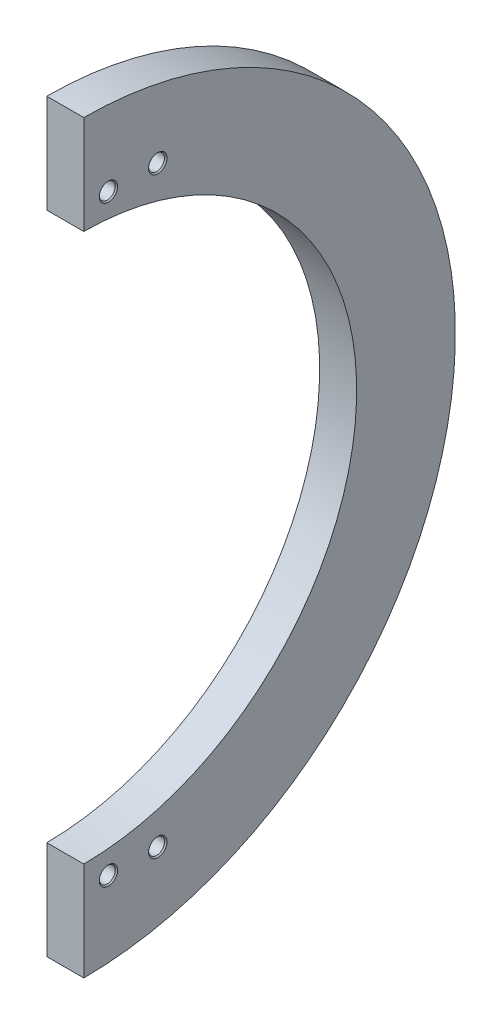
ISO-10303-21;
HEADER;
FILE_DESCRIPTION(('STEP AP214'),'2;1');
FILE_NAME('part.step','',(''),(''),'','','');
FILE_SCHEMA(('AUTOMOTIVE_DESIGN { 1 0 10303 214 1 1 1 1 }'));
ENDSEC;
DATA;
#1=APPLICATION_CONTEXT('core data for automotive mechanical design processes');
#2=APPLICATION_PROTOCOL_DEFINITION('international standard','automotive_design',2000,#1);
#3=PRODUCT_CONTEXT('',#1,'mechanical');
#4=PRODUCT('Part','Part','',(#3));
#5=PRODUCT_RELATED_PRODUCT_CATEGORY('part','',(#4));
#6=PRODUCT_DEFINITION_FORMATION('','',#4);
#7=PRODUCT_DEFINITION_CONTEXT('part definition',#1,'design');
#8=PRODUCT_DEFINITION('design','',#6,#7);
#9=PRODUCT_DEFINITION_SHAPE('','',#8);
#10=(LENGTH_UNIT() NAMED_UNIT(*) SI_UNIT(.MILLI.,.METRE.));
#11=(NAMED_UNIT(*) PLANE_ANGLE_UNIT() SI_UNIT($,.RADIAN.));
#12=(NAMED_UNIT(*) SI_UNIT($,.STERADIAN.) SOLID_ANGLE_UNIT());
#13=UNCERTAINTY_MEASURE_WITH_UNIT(LENGTH_MEASURE(1.E-05),#10,'distance_accuracy_value','');
#14=(GEOMETRIC_REPRESENTATION_CONTEXT(3) GLOBAL_UNCERTAINTY_ASSIGNED_CONTEXT((#13)) GLOBAL_UNIT_ASSIGNED_CONTEXT((#10,
#11,#12)) REPRESENTATION_CONTEXT('',''));
#15=CARTESIAN_POINT('',(0.,0.,0.));
#16=DIRECTION('',(0.,0.,1.));
#17=DIRECTION('',(1.,0.,0.));
#18=AXIS2_PLACEMENT_3D('',#15,#16,#17);
#19=CARTESIAN_POINT('',(19.05,-191.7625,1.33907038047981E-12));
#20=DIRECTION('',(-1.,0.,0.));
#21=DIRECTION('',(0.,0.,1.));
#22=AXIS2_PLACEMENT_3D('',#19,#20,#21);
#23=PLANE('',#22);
#24=CARTESIAN_POINT('',(19.05,152.4,-38.6000000000001));
#25=DIRECTION('',(1.,0.,0.));
#26=DIRECTION('',(0.,0.,-1.));
#27=AXIS2_PLACEMENT_3D('',#24,#25,#26);
#28=CIRCLE('',#27,4.73709999999999);
#29=CARTESIAN_POINT('',(19.05,152.4,-43.3371));
#30=VERTEX_POINT('',#29);
#31=EDGE_CURVE('E144',#30,#30,#28,.T.);
#32=ORIENTED_EDGE('',*,*,#31,.F.);
#33=EDGE_LOOP('',(#32));
#34=FACE_BOUND('',#33,.T.);
#35=CARTESIAN_POINT('',(19.05,152.4,-13.2000000000001));
#36=DIRECTION('',(1.,0.,0.));
#37=DIRECTION('',(0.,0.,-1.));
#38=AXIS2_PLACEMENT_3D('',#35,#36,#37);
#39=CIRCLE('',#38,4.73709999999999);
#40=CARTESIAN_POINT('',(19.05,152.4,-17.9371));
#41=VERTEX_POINT('',#40);
#42=EDGE_CURVE('E132',#41,#41,#39,.T.);
#43=ORIENTED_EDGE('',*,*,#42,.F.);
#44=EDGE_LOOP('',(#43));
#45=FACE_BOUND('',#44,.T.);
#46=CARTESIAN_POINT('',(19.05,-152.4,-38.6000000000001));
#47=DIRECTION('',(1.,0.,0.));
#48=DIRECTION('',(0.,0.,-1.));
#49=AXIS2_PLACEMENT_3D('',#46,#47,#48);
#50=CIRCLE('',#49,4.73709999999999);
#51=CARTESIAN_POINT('',(19.05,-152.4,-43.3371));
#52=VERTEX_POINT('',#51);
#53=EDGE_CURVE('E120',#52,#52,#50,.T.);
#54=ORIENTED_EDGE('',*,*,#53,.F.);
#55=EDGE_LOOP('',(#54));
#56=FACE_BOUND('',#55,.T.);
#57=DIRECTION('',(0.,1.,0.));
#58=VECTOR('',#57,1.);
#59=CARTESIAN_POINT('',(19.05,215.,-0.500000000000053));
#60=LINE('',#59,#58);
#61=CARTESIAN_POINT('',(19.05,-191.761848150903,-0.500000000000053));
#62=VERTEX_POINT('',#61);
#63=CARTESIAN_POINT('',(19.05,-140.961613236548,-0.500000000000053));
#64=VERTEX_POINT('',#63);
#65=EDGE_CURVE('E99',#62,#64,#60,.T.);
#66=ORIENTED_EDGE('',*,*,#65,.F.);
#67=CARTESIAN_POINT('',(19.05,0.,0.));
#68=DIRECTION('',(1.,0.,0.));
#69=DIRECTION('',(0.,0.,-1.));
#70=AXIS2_PLACEMENT_3D('',#67,#68,#69);
#71=CIRCLE('',#70,191.7625);
#72=CARTESIAN_POINT('',(19.05,191.761848150903,-0.500000000000053));
#73=VERTEX_POINT('',#72);
#74=EDGE_CURVE('E88',#62,#73,#71,.T.);
#75=ORIENTED_EDGE('',*,*,#74,.T.);
#76=CARTESIAN_POINT('',(19.05,140.961613236547,-0.500000000000053));
#77=VERTEX_POINT('',#76);
#78=EDGE_CURVE('E79',#77,#73,#60,.T.);
#79=ORIENTED_EDGE('',*,*,#78,.F.);
#80=CARTESIAN_POINT('',(19.05,0.,0.));
#81=DIRECTION('',(1.,0.,0.));
#82=DIRECTION('',(0.,0.,-1.));
#83=AXIS2_PLACEMENT_3D('',#80,#81,#82);
#84=CIRCLE('',#83,140.9625);
#85=EDGE_CURVE('E92',#64,#77,#84,.T.);
#86=ORIENTED_EDGE('',*,*,#85,.F.);
#87=EDGE_LOOP('',(#66,#75,#79,#86));
#88=FACE_BOUND('',#87,.T.);
#89=CARTESIAN_POINT('',(19.05,-152.4,-13.2000000000001));
#90=DIRECTION('',(1.,0.,0.));
#91=DIRECTION('',(0.,0.,-1.));
#92=AXIS2_PLACEMENT_3D('',#89,#90,#91);
#93=CIRCLE('',#92,4.73709999999999);
#94=CARTESIAN_POINT('',(19.05,-152.4,-17.9371));
#95=VERTEX_POINT('',#94);
#96=EDGE_CURVE('E108',#95,#95,#93,.T.);
#97=ORIENTED_EDGE('',*,*,#96,.F.);
#98=EDGE_LOOP('',(#97));
#99=FACE_BOUND('',#98,.T.);
#100=ADVANCED_FACE('F33',(#34,#45,#56,#88,#99),#23,.F.);
#101=CARTESIAN_POINT('',(0.,0.,0.));
#102=DIRECTION('',(1.,0.,0.));
#103=DIRECTION('',(0.,0.,-1.));
#104=AXIS2_PLACEMENT_3D('',#101,#102,#103);
#105=CYLINDRICAL_SURFACE('',#104,140.9625);
#106=CARTESIAN_POINT('',(0.,0.,0.));
#107=DIRECTION('',(1.,0.,0.));
#108=DIRECTION('',(0.,0.,-1.));
#109=AXIS2_PLACEMENT_3D('',#106,#107,#108);
#110=CIRCLE('',#109,140.9625);
#111=CARTESIAN_POINT('',(0.,-140.961613236548,-0.500000000000053));
#112=VERTEX_POINT('',#111);
#113=CARTESIAN_POINT('',(0.,140.961613236547,-0.500000000000053));
#114=VERTEX_POINT('',#113);
#115=EDGE_CURVE('E11',#112,#114,#110,.T.);
#116=ORIENTED_EDGE('',*,*,#115,.F.);
#117=DIRECTION('',(1.,0.,0.));
#118=VECTOR('',#117,1.);
#119=CARTESIAN_POINT('',(0.,-140.961613236547,-0.500000000000053));
#120=LINE('',#119,#118);
#121=EDGE_CURVE('E75',#112,#64,#120,.T.);
#122=ORIENTED_EDGE('',*,*,#121,.T.);
#123=ORIENTED_EDGE('',*,*,#85,.T.);
#124=DIRECTION('',(1.,0.,0.));
#125=VECTOR('',#124,1.);
#126=CARTESIAN_POINT('',(0.,140.961613236547,-0.500000000000053));
#127=LINE('',#126,#125);
#128=EDGE_CURVE('E48',#77,#114,#127,.F.);
#129=ORIENTED_EDGE('',*,*,#128,.T.);
#130=EDGE_LOOP('',(#116,#122,#123,#129));
#131=FACE_BOUND('',#130,.T.);
#132=ADVANCED_FACE('F174',(#131),#105,.F.);
#133=CARTESIAN_POINT('',(0.,-140.9625,9.8433587645335E-13));
#134=DIRECTION('',(1.,0.,0.));
#135=DIRECTION('',(0.,0.,-1.));
#136=AXIS2_PLACEMENT_3D('',#133,#134,#135);
#137=PLANE('',#136);
#138=CARTESIAN_POINT('',(0.,152.4,-38.6000000000001));
#139=DIRECTION('',(1.,0.,0.));
#140=DIRECTION('',(0.,0.,-1.));
#141=AXIS2_PLACEMENT_3D('',#138,#139,#140);
#142=CIRCLE('',#141,4.73709999999999);
#143=CARTESIAN_POINT('',(0.,152.4,-43.3371));
#144=VERTEX_POINT('',#143);
#145=EDGE_CURVE('E147',#144,#144,#142,.T.);
#146=ORIENTED_EDGE('',*,*,#145,.T.);
#147=EDGE_LOOP('',(#146));
#148=FACE_BOUND('',#147,.T.);
#149=CARTESIAN_POINT('',(0.,152.4,-13.2000000000001));
#150=DIRECTION('',(1.,0.,0.));
#151=DIRECTION('',(0.,0.,-1.));
#152=AXIS2_PLACEMENT_3D('',#149,#150,#151);
#153=CIRCLE('',#152,4.73709999999999);
#154=CARTESIAN_POINT('',(0.,152.4,-17.9371));
#155=VERTEX_POINT('',#154);
#156=EDGE_CURVE('E135',#155,#155,#153,.T.);
#157=ORIENTED_EDGE('',*,*,#156,.T.);
#158=EDGE_LOOP('',(#157));
#159=FACE_BOUND('',#158,.T.);
#160=CARTESIAN_POINT('',(0.,-152.4,-38.6000000000001));
#161=DIRECTION('',(1.,0.,0.));
#162=DIRECTION('',(0.,0.,-1.));
#163=AXIS2_PLACEMENT_3D('',#160,#161,#162);
#164=CIRCLE('',#163,4.73709999999999);
#165=CARTESIAN_POINT('',(0.,-152.4,-43.3371));
#166=VERTEX_POINT('',#165);
#167=EDGE_CURVE('E123',#166,#166,#164,.T.);
#168=ORIENTED_EDGE('',*,*,#167,.T.);
#169=EDGE_LOOP('',(#168));
#170=FACE_BOUND('',#169,.T.);
#171=CARTESIAN_POINT('',(0.,-152.4,-13.2000000000001));
#172=DIRECTION('',(1.,0.,0.));
#173=DIRECTION('',(0.,0.,-1.));
#174=AXIS2_PLACEMENT_3D('',#171,#172,#173);
#175=CIRCLE('',#174,4.73709999999999);
#176=CARTESIAN_POINT('',(0.,-152.4,-17.9371));
#177=VERTEX_POINT('',#176);
#178=EDGE_CURVE('E111',#177,#177,#175,.T.);
#179=ORIENTED_EDGE('',*,*,#178,.T.);
#180=EDGE_LOOP('',(#179));
#181=FACE_BOUND('',#180,.T.);
#182=DIRECTION('',(0.,1.,0.));
#183=VECTOR('',#182,1.);
#184=CARTESIAN_POINT('',(0.,215.,-0.500000000000053));
#185=LINE('',#184,#183);
#186=CARTESIAN_POINT('',(0.,191.761848150903,-0.500000000000053));
#187=VERTEX_POINT('',#186);
#188=EDGE_CURVE('E80',#114,#187,#185,.T.);
#189=ORIENTED_EDGE('',*,*,#188,.T.);
#190=CARTESIAN_POINT('',(0.,0.,0.));
#191=DIRECTION('',(1.,0.,0.));
#192=DIRECTION('',(0.,0.,-1.));
#193=AXIS2_PLACEMENT_3D('',#190,#191,#192);
#194=CIRCLE('',#193,191.7625);
#195=CARTESIAN_POINT('',(0.,-191.761848150903,-0.500000000000053));
#196=VERTEX_POINT('',#195);
#197=EDGE_CURVE('E41',#196,#187,#194,.T.);
#198=ORIENTED_EDGE('',*,*,#197,.F.);
#199=EDGE_CURVE('E72',#196,#112,#185,.T.);
#200=ORIENTED_EDGE('',*,*,#199,.T.);
#201=ORIENTED_EDGE('',*,*,#115,.T.);
#202=EDGE_LOOP('',(#189,#198,#200,#201));
#203=FACE_BOUND('',#202,.T.);
#204=ADVANCED_FACE('F35',(#148,#159,#170,#181,#203),#137,.F.);
#205=CARTESIAN_POINT('',(0.,0.,0.));
#206=DIRECTION('',(1.,0.,0.));
#207=DIRECTION('',(0.,0.,-1.));
#208=AXIS2_PLACEMENT_3D('',#205,#206,#207);
#209=CYLINDRICAL_SURFACE('',#208,191.7625);
#210=DIRECTION('',(1.,0.,0.));
#211=VECTOR('',#210,1.);
#212=CARTESIAN_POINT('',(0.,-191.761848150903,-0.500000000000053));
#213=LINE('',#212,#211);
#214=EDGE_CURVE('E56',#196,#62,#213,.T.);
#215=ORIENTED_EDGE('',*,*,#214,.F.);
#216=ORIENTED_EDGE('',*,*,#197,.T.);
#217=DIRECTION('',(1.,0.,0.));
#218=VECTOR('',#217,1.);
#219=CARTESIAN_POINT('',(0.,191.761848150903,-0.500000000000053));
#220=LINE('',#219,#218);
#221=EDGE_CURVE('E89',#73,#187,#220,.F.);
#222=ORIENTED_EDGE('',*,*,#221,.F.);
#223=ORIENTED_EDGE('',*,*,#74,.F.);
#224=EDGE_LOOP('',(#215,#216,#222,#223));
#225=FACE_BOUND('',#224,.T.);
#226=ADVANCED_FACE('F85',(#225),#209,.T.);
#227=CARTESIAN_POINT('',(19.05,215.,-0.500000000000053));
#228=DIRECTION('',(0.,0.,1.));
#229=DIRECTION('',(1.,0.,0.));
#230=AXIS2_PLACEMENT_3D('',#227,#228,#229);
#231=PLANE('',#230);
#232=ORIENTED_EDGE('',*,*,#78,.T.);
#233=ORIENTED_EDGE('',*,*,#221,.T.);
#234=ORIENTED_EDGE('',*,*,#188,.F.);
#235=ORIENTED_EDGE('',*,*,#128,.F.);
#236=EDGE_LOOP('',(#232,#233,#234,#235));
#237=FACE_BOUND('',#236,.T.);
#238=ADVANCED_FACE('F208',(#237),#231,.T.);
#239=ORIENTED_EDGE('',*,*,#199,.F.);
#240=ORIENTED_EDGE('',*,*,#214,.T.);
#241=ORIENTED_EDGE('',*,*,#65,.T.);
#242=ORIENTED_EDGE('',*,*,#121,.F.);
#243=EDGE_LOOP('',(#239,#240,#241,#242));
#244=FACE_BOUND('',#243,.T.);
#245=ADVANCED_FACE('F73',(#244),#231,.T.);
#246=CARTESIAN_POINT('',(0.635000000000004,-152.4,-13.2000000000001));
#247=DIRECTION('',(-1.,0.,0.));
#248=DIRECTION('',(0.,0.,1.));
#249=AXIS2_PLACEMENT_3D('',#246,#247,#248);
#250=CONICAL_SURFACE('',#249,4.1021,0.785398163397443);
#251=ORIENTED_EDGE('',*,*,#178,.F.);
#252=EDGE_LOOP('',(#251));
#253=FACE_BOUND('',#252,.T.);
#254=CARTESIAN_POINT('',(0.635000000000004,-152.4,-13.2000000000001));
#255=DIRECTION('',(1.,0.,0.));
#256=DIRECTION('',(0.,0.,-1.));
#257=AXIS2_PLACEMENT_3D('',#254,#255,#256);
#258=CIRCLE('',#257,4.1021);
#259=CARTESIAN_POINT('',(0.635000000000004,-152.4,-17.3021));
#260=VERTEX_POINT('',#259);
#261=EDGE_CURVE('E101',#260,#260,#258,.T.);
#262=ORIENTED_EDGE('',*,*,#261,.T.);
#263=EDGE_LOOP('',(#262));
#264=FACE_BOUND('',#263,.T.);
#265=ADVANCED_FACE('F197',(#253,#264),#250,.F.);
#266=CARTESIAN_POINT('',(19.05,-152.4,-13.2000000000001));
#267=DIRECTION('',(1.,0.,0.));
#268=DIRECTION('',(0.,0.,-1.));
#269=AXIS2_PLACEMENT_3D('',#266,#267,#268);
#270=CYLINDRICAL_SURFACE('',#269,4.1021);
#271=ORIENTED_EDGE('',*,*,#261,.F.);
#272=EDGE_LOOP('',(#271));
#273=FACE_BOUND('',#272,.T.);
#274=CARTESIAN_POINT('',(18.415,-152.4,-13.2000000000001));
#275=DIRECTION('',(1.,0.,0.));
#276=DIRECTION('',(0.,0.,-1.));
#277=AXIS2_PLACEMENT_3D('',#274,#275,#276);
#278=CIRCLE('',#277,4.1021);
#279=CARTESIAN_POINT('',(18.415,-152.4,-17.3021));
#280=VERTEX_POINT('',#279);
#281=EDGE_CURVE('E105',#280,#280,#278,.T.);
#282=ORIENTED_EDGE('',*,*,#281,.T.);
#283=EDGE_LOOP('',(#282));
#284=FACE_BOUND('',#283,.T.);
#285=ADVANCED_FACE('F187',(#273,#284),#270,.F.);
#286=CARTESIAN_POINT('',(19.05,-152.4,-13.2000000000001));
#287=DIRECTION('',(1.,0.,0.));
#288=DIRECTION('',(0.,0.,-1.));
#289=AXIS2_PLACEMENT_3D('',#286,#287,#288);
#290=CONICAL_SURFACE('',#289,4.73709999999999,0.785398163397446);
#291=ORIENTED_EDGE('',*,*,#281,.F.);
#292=EDGE_LOOP('',(#291));
#293=FACE_BOUND('',#292,.T.);
#294=ORIENTED_EDGE('',*,*,#96,.T.);
#295=EDGE_LOOP('',(#294));
#296=FACE_BOUND('',#295,.T.);
#297=ADVANCED_FACE('F184',(#293,#296),#290,.F.);
#298=CARTESIAN_POINT('',(0.635000000000004,-152.4,-38.6000000000001));
#299=DIRECTION('',(-1.,0.,0.));
#300=DIRECTION('',(0.,0.,1.));
#301=AXIS2_PLACEMENT_3D('',#298,#299,#300);
#302=CONICAL_SURFACE('',#301,4.1021,0.785398163397443);
#303=ORIENTED_EDGE('',*,*,#167,.F.);
#304=EDGE_LOOP('',(#303));
#305=FACE_BOUND('',#304,.T.);
#306=CARTESIAN_POINT('',(0.635000000000004,-152.4,-38.6000000000001));
#307=DIRECTION('',(1.,0.,0.));
#308=DIRECTION('',(0.,0.,-1.));
#309=AXIS2_PLACEMENT_3D('',#306,#307,#308);
#310=CIRCLE('',#309,4.1021);
#311=CARTESIAN_POINT('',(0.635000000000004,-152.4,-42.7021000000001));
#312=VERTEX_POINT('',#311);
#313=EDGE_CURVE('E114',#312,#312,#310,.T.);
#314=ORIENTED_EDGE('',*,*,#313,.T.);
#315=EDGE_LOOP('',(#314));
#316=FACE_BOUND('',#315,.T.);
#317=ADVANCED_FACE('F186',(#305,#316),#302,.F.);
#318=CARTESIAN_POINT('',(19.05,-152.4,-38.6000000000001));
#319=DIRECTION('',(1.,0.,0.));
#320=DIRECTION('',(0.,0.,-1.));
#321=AXIS2_PLACEMENT_3D('',#318,#319,#320);
#322=CYLINDRICAL_SURFACE('',#321,4.1021);
#323=ORIENTED_EDGE('',*,*,#313,.F.);
#324=EDGE_LOOP('',(#323));
#325=FACE_BOUND('',#324,.T.);
#326=CARTESIAN_POINT('',(18.415,-152.4,-38.6000000000001));
#327=DIRECTION('',(1.,0.,0.));
#328=DIRECTION('',(0.,0.,-1.));
#329=AXIS2_PLACEMENT_3D('',#326,#327,#328);
#330=CIRCLE('',#329,4.1021);
#331=CARTESIAN_POINT('',(18.415,-152.4,-42.7021000000001));
#332=VERTEX_POINT('',#331);
#333=EDGE_CURVE('E117',#332,#332,#330,.T.);
#334=ORIENTED_EDGE('',*,*,#333,.T.);
#335=EDGE_LOOP('',(#334));
#336=FACE_BOUND('',#335,.T.);
#337=ADVANCED_FACE('F194',(#325,#336),#322,.F.);
#338=CARTESIAN_POINT('',(19.05,-152.4,-38.6000000000001));
#339=DIRECTION('',(1.,0.,0.));
#340=DIRECTION('',(0.,0.,-1.));
#341=AXIS2_PLACEMENT_3D('',#338,#339,#340);
#342=CONICAL_SURFACE('',#341,4.73709999999999,0.785398163397446);
#343=ORIENTED_EDGE('',*,*,#333,.F.);
#344=EDGE_LOOP('',(#343));
#345=FACE_BOUND('',#344,.T.);
#346=ORIENTED_EDGE('',*,*,#53,.T.);
#347=EDGE_LOOP('',(#346));
#348=FACE_BOUND('',#347,.T.);
#349=ADVANCED_FACE('F278',(#345,#348),#342,.F.);
#350=CARTESIAN_POINT('',(0.635000000000004,152.4,-13.2000000000001));
#351=DIRECTION('',(-1.,0.,0.));
#352=DIRECTION('',(0.,0.,1.));
#353=AXIS2_PLACEMENT_3D('',#350,#351,#352);
#354=CONICAL_SURFACE('',#353,4.1021,0.785398163397443);
#355=ORIENTED_EDGE('',*,*,#156,.F.);
#356=EDGE_LOOP('',(#355));
#357=FACE_BOUND('',#356,.T.);
#358=CARTESIAN_POINT('',(0.635000000000004,152.4,-13.2000000000001));
#359=DIRECTION('',(1.,0.,0.));
#360=DIRECTION('',(0.,0.,-1.));
#361=AXIS2_PLACEMENT_3D('',#358,#359,#360);
#362=CIRCLE('',#361,4.1021);
#363=CARTESIAN_POINT('',(0.635000000000004,152.4,-17.3021));
#364=VERTEX_POINT('',#363);
#365=EDGE_CURVE('E126',#364,#364,#362,.T.);
#366=ORIENTED_EDGE('',*,*,#365,.T.);
#367=EDGE_LOOP('',(#366));
#368=FACE_BOUND('',#367,.T.);
#369=ADVANCED_FACE('F287',(#357,#368),#354,.F.);
#370=CARTESIAN_POINT('',(19.05,152.4,-13.2000000000001));
#371=DIRECTION('',(1.,0.,0.));
#372=DIRECTION('',(0.,0.,-1.));
#373=AXIS2_PLACEMENT_3D('',#370,#371,#372);
#374=CYLINDRICAL_SURFACE('',#373,4.1021);
#375=ORIENTED_EDGE('',*,*,#365,.F.);
#376=EDGE_LOOP('',(#375));
#377=FACE_BOUND('',#376,.T.);
#378=CARTESIAN_POINT('',(18.415,152.4,-13.2000000000001));
#379=DIRECTION('',(1.,0.,0.));
#380=DIRECTION('',(0.,0.,-1.));
#381=AXIS2_PLACEMENT_3D('',#378,#379,#380);
#382=CIRCLE('',#381,4.1021);
#383=CARTESIAN_POINT('',(18.415,152.4,-17.3021));
#384=VERTEX_POINT('',#383);
#385=EDGE_CURVE('E129',#384,#384,#382,.T.);
#386=ORIENTED_EDGE('',*,*,#385,.T.);
#387=EDGE_LOOP('',(#386));
#388=FACE_BOUND('',#387,.T.);
#389=ADVANCED_FACE('F297',(#377,#388),#374,.F.);
#390=CARTESIAN_POINT('',(19.05,152.4,-13.2000000000001));
#391=DIRECTION('',(1.,0.,0.));
#392=DIRECTION('',(0.,0.,-1.));
#393=AXIS2_PLACEMENT_3D('',#390,#391,#392);
#394=CONICAL_SURFACE('',#393,4.73709999999999,0.785398163397446);
#395=ORIENTED_EDGE('',*,*,#385,.F.);
#396=EDGE_LOOP('',(#395));
#397=FACE_BOUND('',#396,.T.);
#398=ORIENTED_EDGE('',*,*,#42,.T.);
#399=EDGE_LOOP('',(#398));
#400=FACE_BOUND('',#399,.T.);
#401=ADVANCED_FACE('F157',(#397,#400),#394,.F.);
#402=CARTESIAN_POINT('',(0.635000000000004,152.4,-38.6000000000001));
#403=DIRECTION('',(-1.,0.,0.));
#404=DIRECTION('',(0.,0.,1.));
#405=AXIS2_PLACEMENT_3D('',#402,#403,#404);
#406=CONICAL_SURFACE('',#405,4.1021,0.785398163397443);
#407=ORIENTED_EDGE('',*,*,#145,.F.);
#408=EDGE_LOOP('',(#407));
#409=FACE_BOUND('',#408,.T.);
#410=CARTESIAN_POINT('',(0.635000000000004,152.4,-38.6000000000001));
#411=DIRECTION('',(1.,0.,0.));
#412=DIRECTION('',(0.,0.,-1.));
#413=AXIS2_PLACEMENT_3D('',#410,#411,#412);
#414=CIRCLE('',#413,4.1021);
#415=CARTESIAN_POINT('',(0.635000000000004,152.4,-42.7021000000001));
#416=VERTEX_POINT('',#415);
#417=EDGE_CURVE('E138',#416,#416,#414,.T.);
#418=ORIENTED_EDGE('',*,*,#417,.T.);
#419=EDGE_LOOP('',(#418));
#420=FACE_BOUND('',#419,.T.);
#421=ADVANCED_FACE('F153',(#409,#420),#406,.F.);
#422=CARTESIAN_POINT('',(19.05,152.4,-38.6000000000001));
#423=DIRECTION('',(1.,0.,0.));
#424=DIRECTION('',(0.,0.,-1.));
#425=AXIS2_PLACEMENT_3D('',#422,#423,#424);
#426=CYLINDRICAL_SURFACE('',#425,4.1021);
#427=ORIENTED_EDGE('',*,*,#417,.F.);
#428=EDGE_LOOP('',(#427));
#429=FACE_BOUND('',#428,.T.);
#430=CARTESIAN_POINT('',(18.415,152.4,-38.6000000000001));
#431=DIRECTION('',(1.,0.,0.));
#432=DIRECTION('',(0.,0.,-1.));
#433=AXIS2_PLACEMENT_3D('',#430,#431,#432);
#434=CIRCLE('',#433,4.1021);
#435=CARTESIAN_POINT('',(18.415,152.4,-42.7021000000001));
#436=VERTEX_POINT('',#435);
#437=EDGE_CURVE('E141',#436,#436,#434,.T.);
#438=ORIENTED_EDGE('',*,*,#437,.T.);
#439=EDGE_LOOP('',(#438));
#440=FACE_BOUND('',#439,.T.);
#441=ADVANCED_FACE('F156',(#429,#440),#426,.F.);
#442=CARTESIAN_POINT('',(19.05,152.4,-38.6000000000001));
#443=DIRECTION('',(1.,0.,0.));
#444=DIRECTION('',(0.,0.,-1.));
#445=AXIS2_PLACEMENT_3D('',#442,#443,#444);
#446=CONICAL_SURFACE('',#445,4.73709999999999,0.785398163397446);
#447=ORIENTED_EDGE('',*,*,#437,.F.);
#448=EDGE_LOOP('',(#447));
#449=FACE_BOUND('',#448,.T.);
#450=ORIENTED_EDGE('',*,*,#31,.T.);
#451=EDGE_LOOP('',(#450));
#452=FACE_BOUND('',#451,.T.);
#453=ADVANCED_FACE('F163',(#449,#452),#446,.F.);
#454=CLOSED_SHELL('',(#100,#132,#204,#226,#238,#245,#265,#285,#297,#317,#337,#349,#369,#389,
#401,#421,#441,#453));
#455=MANIFOLD_SOLID_BREP('B2',#454);
#456=ADVANCED_BREP_SHAPE_REPRESENTATION('',(#18,#455),#14);
#457=SHAPE_DEFINITION_REPRESENTATION(#9,#456);
ENDSEC;
END-ISO-10303-21;
